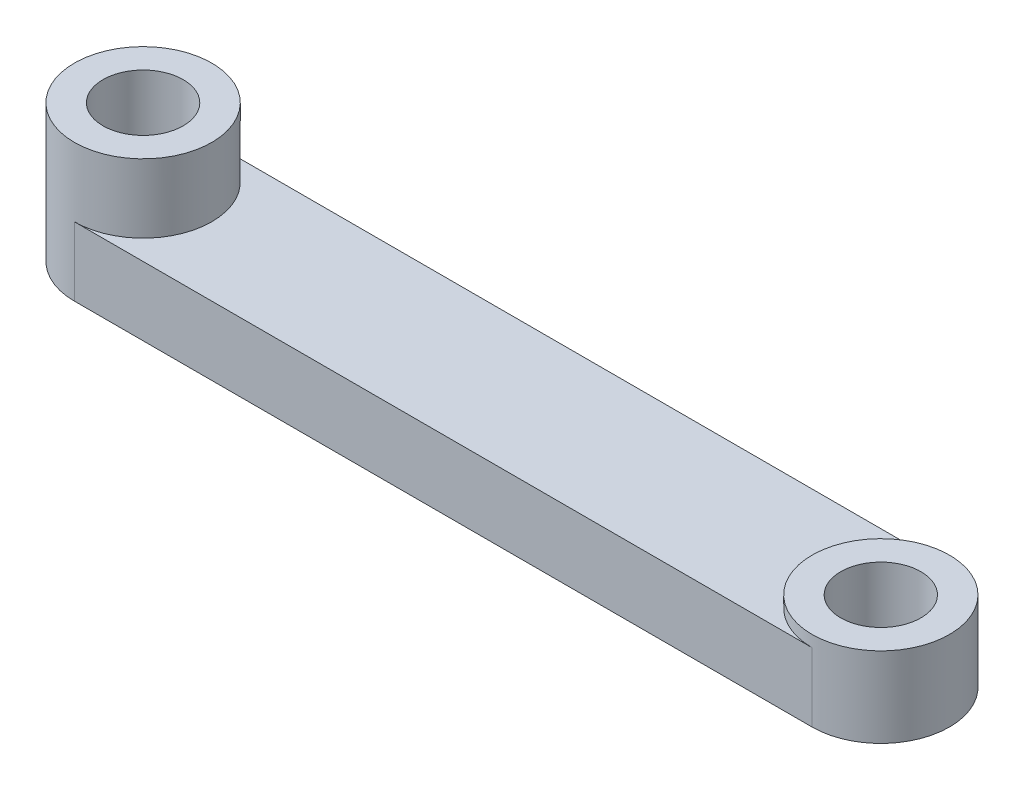
ISO-10303-21;
HEADER;
FILE_DESCRIPTION(('STEP AP214'),'2;1');
FILE_NAME('part.step','',(''),(''),'','','');
FILE_SCHEMA(('AUTOMOTIVE_DESIGN { 1 0 10303 214 1 1 1 1 }'));
ENDSEC;
DATA;
#1=APPLICATION_CONTEXT('core data for automotive mechanical design processes');
#2=APPLICATION_PROTOCOL_DEFINITION('international standard','automotive_design',2000,#1);
#3=PRODUCT_CONTEXT('',#1,'mechanical');
#4=PRODUCT('Part','Part','',(#3));
#5=PRODUCT_RELATED_PRODUCT_CATEGORY('part','',(#4));
#6=PRODUCT_DEFINITION_FORMATION('','',#4);
#7=PRODUCT_DEFINITION_CONTEXT('part definition',#1,'design');
#8=PRODUCT_DEFINITION('design','',#6,#7);
#9=PRODUCT_DEFINITION_SHAPE('','',#8);
#10=(LENGTH_UNIT() NAMED_UNIT(*) SI_UNIT(.MILLI.,.METRE.));
#11=(NAMED_UNIT(*) PLANE_ANGLE_UNIT() SI_UNIT($,.RADIAN.));
#12=(NAMED_UNIT(*) SI_UNIT($,.STERADIAN.) SOLID_ANGLE_UNIT());
#13=UNCERTAINTY_MEASURE_WITH_UNIT(LENGTH_MEASURE(1.E-05),#10,'distance_accuracy_value','');
#14=(GEOMETRIC_REPRESENTATION_CONTEXT(3) GLOBAL_UNCERTAINTY_ASSIGNED_CONTEXT((#13)) GLOBAL_UNIT_ASSIGNED_CONTEXT((#10,
#11,#12)) REPRESENTATION_CONTEXT('',''));
#15=CARTESIAN_POINT('',(0.,0.,0.));
#16=DIRECTION('',(0.,0.,1.));
#17=DIRECTION('',(1.,0.,0.));
#18=AXIS2_PLACEMENT_3D('',#15,#16,#17);
#19=CARTESIAN_POINT('',(0.,3.,0.));
#20=DIRECTION('',(0.,-1.,0.));
#21=DIRECTION('',(0.,0.,-1.));
#22=AXIS2_PLACEMENT_3D('',#19,#20,#21);
#23=CYLINDRICAL_SURFACE('',#22,3.);
#24=CARTESIAN_POINT('',(0.,0.,0.));
#25=DIRECTION('',(0.,1.,0.));
#26=DIRECTION('',(0.,0.,1.));
#27=AXIS2_PLACEMENT_3D('',#24,#25,#26);
#28=CIRCLE('',#27,3.);
#29=CARTESIAN_POINT('',(0.,0.,-3.));
#30=VERTEX_POINT('',#29);
#31=CARTESIAN_POINT('',(0.,0.,3.));
#32=VERTEX_POINT('',#31);
#33=EDGE_CURVE('E97',#30,#32,#28,.T.);
#34=ORIENTED_EDGE('',*,*,#33,.T.);
#35=DIRECTION('',(0.,-1.,0.));
#36=VECTOR('',#35,1.);
#37=CARTESIAN_POINT('',(0.,3.,3.));
#38=LINE('',#37,#36);
#39=CARTESIAN_POINT('',(0.,3.,3.));
#40=VERTEX_POINT('',#39);
#41=EDGE_CURVE('E50',#40,#32,#38,.T.);
#42=ORIENTED_EDGE('',*,*,#41,.F.);
#43=CARTESIAN_POINT('',(0.,3.,0.));
#44=DIRECTION('',(0.,1.,0.));
#45=DIRECTION('',(0.,0.,1.));
#46=AXIS2_PLACEMENT_3D('',#43,#44,#45);
#47=CIRCLE('',#46,3.);
#48=CARTESIAN_POINT('',(0.,3.,-3.));
#49=VERTEX_POINT('',#48);
#50=EDGE_CURVE('E98',#40,#49,#47,.T.);
#51=ORIENTED_EDGE('',*,*,#50,.T.);
#52=DIRECTION('',(0.,-1.,0.));
#53=VECTOR('',#52,1.);
#54=CARTESIAN_POINT('',(0.,3.,-3.));
#55=LINE('',#54,#53);
#56=EDGE_CURVE('E85',#49,#30,#55,.T.);
#57=ORIENTED_EDGE('',*,*,#56,.T.);
#58=EDGE_LOOP('',(#34,#42,#51,#57));
#59=FACE_BOUND('',#58,.T.);
#60=CARTESIAN_POINT('',(0.,6.,0.));
#61=DIRECTION('',(0.,1.,0.));
#62=DIRECTION('',(0.,0.,1.));
#63=AXIS2_PLACEMENT_3D('',#60,#61,#62);
#64=CIRCLE('',#63,3.);
#65=CARTESIAN_POINT('',(0.,6.,3.));
#66=VERTEX_POINT('',#65);
#67=EDGE_CURVE('E115',#66,#66,#64,.T.);
#68=ORIENTED_EDGE('',*,*,#67,.F.);
#69=EDGE_LOOP('',(#68));
#70=FACE_BOUND('',#69,.T.);
#71=ADVANCED_FACE('F40',(#59,#70),#23,.T.);
#72=CARTESIAN_POINT('',(0.,3.,3.));
#73=DIRECTION('',(0.,0.,-1.));
#74=DIRECTION('',(-1.,0.,0.));
#75=AXIS2_PLACEMENT_3D('',#72,#73,#74);
#76=PLANE('',#75);
#77=DIRECTION('',(1.,0.,0.));
#78=VECTOR('',#77,1.);
#79=CARTESIAN_POINT('',(0.,0.,3.));
#80=LINE('',#79,#78);
#81=CARTESIAN_POINT('',(32.2,0.,3.));
#82=VERTEX_POINT('',#81);
#83=EDGE_CURVE('E103',#32,#82,#80,.T.);
#84=ORIENTED_EDGE('',*,*,#83,.T.);
#85=DIRECTION('',(0.,-1.,0.));
#86=VECTOR('',#85,1.);
#87=CARTESIAN_POINT('',(32.2,3.,3.));
#88=LINE('',#87,#86);
#89=CARTESIAN_POINT('',(32.2,3.,3.));
#90=VERTEX_POINT('',#89);
#91=EDGE_CURVE('E124',#90,#82,#88,.T.);
#92=ORIENTED_EDGE('',*,*,#91,.F.);
#93=DIRECTION('',(1.,0.,0.));
#94=VECTOR('',#93,1.);
#95=CARTESIAN_POINT('',(0.,3.,3.));
#96=LINE('',#95,#94);
#97=EDGE_CURVE('E90',#40,#90,#96,.T.);
#98=ORIENTED_EDGE('',*,*,#97,.F.);
#99=ORIENTED_EDGE('',*,*,#41,.T.);
#100=EDGE_LOOP('',(#84,#92,#98,#99));
#101=FACE_BOUND('',#100,.T.);
#102=ADVANCED_FACE('F131',(#101),#76,.F.);
#103=CARTESIAN_POINT('',(32.2,3.,0.));
#104=DIRECTION('',(0.,-1.,0.));
#105=DIRECTION('',(0.,0.,-1.));
#106=AXIS2_PLACEMENT_3D('',#103,#104,#105);
#107=CYLINDRICAL_SURFACE('',#106,3.);
#108=CARTESIAN_POINT('',(32.2,0.,0.));
#109=DIRECTION('',(0.,1.,0.));
#110=DIRECTION('',(0.,0.,1.));
#111=AXIS2_PLACEMENT_3D('',#108,#109,#110);
#112=CIRCLE('',#111,3.);
#113=CARTESIAN_POINT('',(32.2,0.,-3.));
#114=VERTEX_POINT('',#113);
#115=EDGE_CURVE('E74',#82,#114,#112,.T.);
#116=ORIENTED_EDGE('',*,*,#115,.T.);
#117=DIRECTION('',(0.,-1.,0.));
#118=VECTOR('',#117,1.);
#119=CARTESIAN_POINT('',(32.2,3.,-3.));
#120=LINE('',#119,#118);
#121=CARTESIAN_POINT('',(32.2,3.,-3.));
#122=VERTEX_POINT('',#121);
#123=EDGE_CURVE('E86',#122,#114,#120,.T.);
#124=ORIENTED_EDGE('',*,*,#123,.F.);
#125=CARTESIAN_POINT('',(32.2,3.,0.));
#126=DIRECTION('',(0.,1.,0.));
#127=DIRECTION('',(0.,0.,1.));
#128=AXIS2_PLACEMENT_3D('',#125,#126,#127);
#129=CIRCLE('',#128,3.);
#130=EDGE_CURVE('E11',#122,#90,#129,.T.);
#131=ORIENTED_EDGE('',*,*,#130,.T.);
#132=ORIENTED_EDGE('',*,*,#91,.T.);
#133=EDGE_LOOP('',(#116,#124,#131,#132));
#134=FACE_BOUND('',#133,.T.);
#135=CARTESIAN_POINT('',(32.2,3.5,0.));
#136=DIRECTION('',(0.,1.,0.));
#137=DIRECTION('',(0.,0.,1.));
#138=AXIS2_PLACEMENT_3D('',#135,#136,#137);
#139=CIRCLE('',#138,3.);
#140=CARTESIAN_POINT('',(32.2,3.5,3.));
#141=VERTEX_POINT('',#140);
#142=EDGE_CURVE('E106',#141,#141,#139,.T.);
#143=ORIENTED_EDGE('',*,*,#142,.F.);
#144=EDGE_LOOP('',(#143));
#145=FACE_BOUND('',#144,.T.);
#146=ADVANCED_FACE('F167',(#134,#145),#107,.T.);
#147=CARTESIAN_POINT('',(0.,3.,-3.));
#148=DIRECTION('',(0.,0.,1.));
#149=DIRECTION('',(1.,0.,0.));
#150=AXIS2_PLACEMENT_3D('',#147,#148,#149);
#151=PLANE('',#150);
#152=DIRECTION('',(-1.,0.,0.));
#153=VECTOR('',#152,1.);
#154=CARTESIAN_POINT('',(0.,0.,-3.));
#155=LINE('',#154,#153);
#156=EDGE_CURVE('E80',#114,#30,#155,.T.);
#157=ORIENTED_EDGE('',*,*,#156,.T.);
#158=ORIENTED_EDGE('',*,*,#56,.F.);
#159=DIRECTION('',(-1.,0.,0.));
#160=VECTOR('',#159,1.);
#161=CARTESIAN_POINT('',(0.,3.,-3.));
#162=LINE('',#161,#160);
#163=EDGE_CURVE('E100',#122,#49,#162,.T.);
#164=ORIENTED_EDGE('',*,*,#163,.F.);
#165=ORIENTED_EDGE('',*,*,#123,.T.);
#166=EDGE_LOOP('',(#157,#158,#164,#165));
#167=FACE_BOUND('',#166,.T.);
#168=ADVANCED_FACE('F82',(#167),#151,.F.);
#169=CARTESIAN_POINT('',(0.,3.,0.));
#170=DIRECTION('',(0.,1.,0.));
#171=DIRECTION('',(0.,0.,1.));
#172=AXIS2_PLACEMENT_3D('',#169,#170,#171);
#173=PLANE('',#172);
#174=ORIENTED_EDGE('',*,*,#163,.T.);
#175=ORIENTED_EDGE('',*,*,#50,.F.);
#176=ORIENTED_EDGE('',*,*,#97,.T.);
#177=ORIENTED_EDGE('',*,*,#130,.F.);
#178=EDGE_LOOP('',(#174,#175,#176,#177));
#179=FACE_BOUND('',#178,.T.);
#180=ADVANCED_FACE('F174',(#179),#173,.T.);
#181=CARTESIAN_POINT('',(0.,0.,0.));
#182=DIRECTION('',(0.,1.,0.));
#183=DIRECTION('',(0.,0.,1.));
#184=AXIS2_PLACEMENT_3D('',#181,#182,#183);
#185=PLANE('',#184);
#186=CARTESIAN_POINT('',(0.,0.,0.));
#187=DIRECTION('',(0.,1.,0.));
#188=DIRECTION('',(0.,0.,1.));
#189=AXIS2_PLACEMENT_3D('',#186,#187,#188);
#190=CIRCLE('',#189,1.75);
#191=CARTESIAN_POINT('',(0.,0.,1.75));
#192=VERTEX_POINT('',#191);
#193=EDGE_CURVE('E148',#192,#192,#190,.T.);
#194=ORIENTED_EDGE('',*,*,#193,.T.);
#195=EDGE_LOOP('',(#194));
#196=FACE_BOUND('',#195,.T.);
#197=CARTESIAN_POINT('',(32.2,0.,0.));
#198=DIRECTION('',(0.,1.,0.));
#199=DIRECTION('',(0.,0.,1.));
#200=AXIS2_PLACEMENT_3D('',#197,#198,#199);
#201=CIRCLE('',#200,1.75);
#202=CARTESIAN_POINT('',(32.2,0.,1.75));
#203=VERTEX_POINT('',#202);
#204=EDGE_CURVE('E142',#203,#203,#201,.T.);
#205=ORIENTED_EDGE('',*,*,#204,.T.);
#206=EDGE_LOOP('',(#205));
#207=FACE_BOUND('',#206,.T.);
#208=ORIENTED_EDGE('',*,*,#33,.F.);
#209=ORIENTED_EDGE('',*,*,#156,.F.);
#210=ORIENTED_EDGE('',*,*,#115,.F.);
#211=ORIENTED_EDGE('',*,*,#83,.F.);
#212=EDGE_LOOP('',(#208,#209,#210,#211));
#213=FACE_BOUND('',#212,.T.);
#214=ADVANCED_FACE('F102',(#196,#207,#213),#185,.F.);
#215=CARTESIAN_POINT('',(32.2,3.5,0.));
#216=DIRECTION('',(0.,1.,0.));
#217=DIRECTION('',(0.,0.,1.));
#218=AXIS2_PLACEMENT_3D('',#215,#216,#217);
#219=PLANE('',#218);
#220=CARTESIAN_POINT('',(32.2,3.5,0.));
#221=DIRECTION('',(0.,1.,0.));
#222=DIRECTION('',(0.,0.,1.));
#223=AXIS2_PLACEMENT_3D('',#220,#221,#222);
#224=CIRCLE('',#223,1.75);
#225=CARTESIAN_POINT('',(32.2,3.5,1.75));
#226=VERTEX_POINT('',#225);
#227=EDGE_CURVE('E43',#226,#226,#224,.T.);
#228=ORIENTED_EDGE('',*,*,#227,.F.);
#229=EDGE_LOOP('',(#228));
#230=FACE_BOUND('',#229,.T.);
#231=ORIENTED_EDGE('',*,*,#142,.T.);
#232=EDGE_LOOP('',(#231));
#233=FACE_BOUND('',#232,.T.);
#234=ADVANCED_FACE('F160',(#230,#233),#219,.T.);
#235=CARTESIAN_POINT('',(0.,6.,0.));
#236=DIRECTION('',(0.,1.,0.));
#237=DIRECTION('',(0.,0.,1.));
#238=AXIS2_PLACEMENT_3D('',#235,#236,#237);
#239=PLANE('',#238);
#240=CARTESIAN_POINT('',(0.,6.,0.));
#241=DIRECTION('',(0.,1.,0.));
#242=DIRECTION('',(0.,0.,1.));
#243=AXIS2_PLACEMENT_3D('',#240,#241,#242);
#244=CIRCLE('',#243,1.75);
#245=CARTESIAN_POINT('',(0.,6.,1.75));
#246=VERTEX_POINT('',#245);
#247=EDGE_CURVE('E145',#246,#246,#244,.T.);
#248=ORIENTED_EDGE('',*,*,#247,.F.);
#249=EDGE_LOOP('',(#248));
#250=FACE_BOUND('',#249,.T.);
#251=ORIENTED_EDGE('',*,*,#67,.T.);
#252=EDGE_LOOP('',(#251));
#253=FACE_BOUND('',#252,.T.);
#254=ADVANCED_FACE('F163',(#250,#253),#239,.T.);
#255=CARTESIAN_POINT('',(0.,0.,0.));
#256=DIRECTION('',(0.,1.,0.));
#257=DIRECTION('',(0.,0.,1.));
#258=AXIS2_PLACEMENT_3D('',#255,#256,#257);
#259=CYLINDRICAL_SURFACE('',#258,1.75);
#260=ORIENTED_EDGE('',*,*,#193,.F.);
#261=EDGE_LOOP('',(#260));
#262=FACE_BOUND('',#261,.T.);
#263=ORIENTED_EDGE('',*,*,#247,.T.);
#264=EDGE_LOOP('',(#263));
#265=FACE_BOUND('',#264,.T.);
#266=ADVANCED_FACE('F219',(#262,#265),#259,.F.);
#267=CARTESIAN_POINT('',(32.2,0.,0.));
#268=DIRECTION('',(0.,1.,0.));
#269=DIRECTION('',(0.,0.,1.));
#270=AXIS2_PLACEMENT_3D('',#267,#268,#269);
#271=CYLINDRICAL_SURFACE('',#270,1.75);
#272=ORIENTED_EDGE('',*,*,#227,.T.);
#273=EDGE_LOOP('',(#272));
#274=FACE_BOUND('',#273,.T.);
#275=ORIENTED_EDGE('',*,*,#204,.F.);
#276=EDGE_LOOP('',(#275));
#277=FACE_BOUND('',#276,.T.);
#278=ADVANCED_FACE('F157',(#274,#277),#271,.F.);
#279=CLOSED_SHELL('',(#71,#102,#146,#168,#180,#214,#234,#254,#266,#278));
#280=MANIFOLD_SOLID_BREP('B2',#279);
#281=ADVANCED_BREP_SHAPE_REPRESENTATION('',(#18,#280),#14);
#282=SHAPE_DEFINITION_REPRESENTATION(#9,#281);
ENDSEC;
END-ISO-10303-21;
